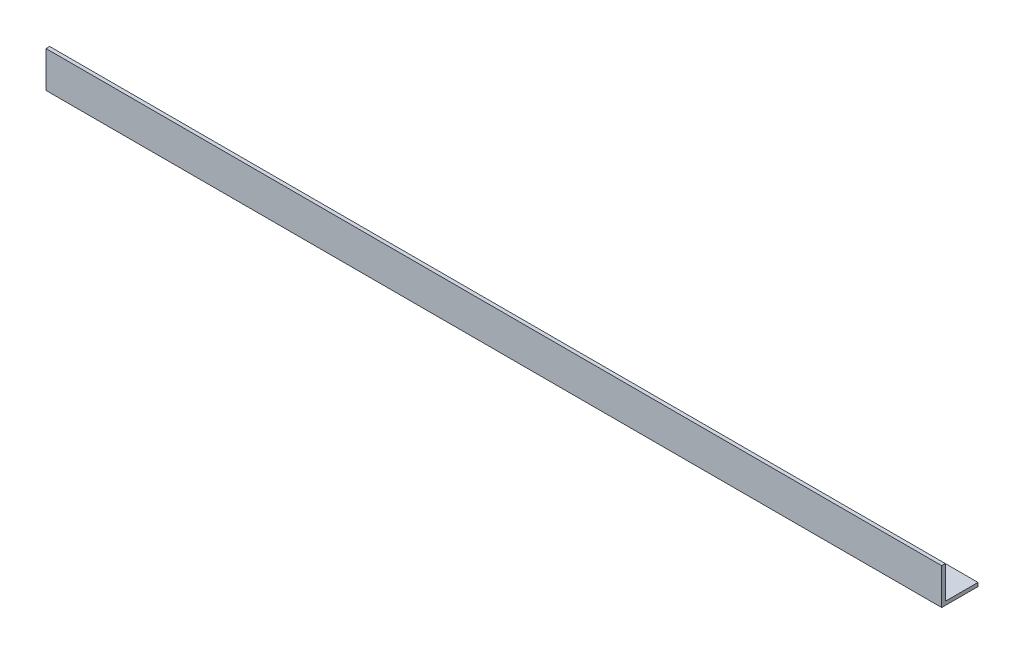
ISO-10303-21;
HEADER;
FILE_DESCRIPTION(('STEP AP214'),'2;1');
FILE_NAME('part.step','',(''),(''),'','','');
FILE_SCHEMA(('AUTOMOTIVE_DESIGN { 1 0 10303 214 1 1 1 1 }'));
ENDSEC;
DATA;
#1=APPLICATION_CONTEXT('core data for automotive mechanical design processes');
#2=APPLICATION_PROTOCOL_DEFINITION('international standard','automotive_design',2000,#1);
#3=PRODUCT_CONTEXT('',#1,'mechanical');
#4=PRODUCT('Part','Part','',(#3));
#5=PRODUCT_RELATED_PRODUCT_CATEGORY('part','',(#4));
#6=PRODUCT_DEFINITION_FORMATION('','',#4);
#7=PRODUCT_DEFINITION_CONTEXT('part definition',#1,'design');
#8=PRODUCT_DEFINITION('design','',#6,#7);
#9=PRODUCT_DEFINITION_SHAPE('','',#8);
#10=(LENGTH_UNIT() NAMED_UNIT(*) SI_UNIT(.MILLI.,.METRE.));
#11=(NAMED_UNIT(*) PLANE_ANGLE_UNIT() SI_UNIT($,.RADIAN.));
#12=(NAMED_UNIT(*) SI_UNIT($,.STERADIAN.) SOLID_ANGLE_UNIT());
#13=UNCERTAINTY_MEASURE_WITH_UNIT(LENGTH_MEASURE(1.E-05),#10,'distance_accuracy_value','');
#14=(GEOMETRIC_REPRESENTATION_CONTEXT(3) GLOBAL_UNCERTAINTY_ASSIGNED_CONTEXT((#13)) GLOBAL_UNIT_ASSIGNED_CONTEXT((#10,
#11,#12)) REPRESENTATION_CONTEXT('',''));
#15=CARTESIAN_POINT('',(0.,0.,0.));
#16=DIRECTION('',(0.,0.,1.));
#17=DIRECTION('',(1.,0.,0.));
#18=AXIS2_PLACEMENT_3D('',#15,#16,#17);
#19=CARTESIAN_POINT('',(370.,0.,-15.));
#20=DIRECTION('',(0.,1.,0.));
#21=DIRECTION('',(0.,0.,1.));
#22=AXIS2_PLACEMENT_3D('',#19,#20,#21);
#23=PLANE('',#22);
#24=DIRECTION('',(0.,0.,-1.));
#25=VECTOR('',#24,1.);
#26=CARTESIAN_POINT('',(0.,0.,-15.));
#27=LINE('',#26,#25);
#28=CARTESIAN_POINT('',(0.,0.,0.));
#29=VERTEX_POINT('',#28);
#30=CARTESIAN_POINT('',(0.,0.,-15.));
#31=VERTEX_POINT('',#30);
#32=EDGE_CURVE('E119',#29,#31,#27,.T.);
#33=ORIENTED_EDGE('',*,*,#32,.T.);
#34=DIRECTION('',(-1.,0.,0.));
#35=VECTOR('',#34,1.);
#36=CARTESIAN_POINT('',(370.,0.,-15.));
#37=LINE('',#36,#35);
#38=CARTESIAN_POINT('',(370.,0.,-15.));
#39=VERTEX_POINT('',#38);
#40=EDGE_CURVE('E11',#39,#31,#37,.T.);
#41=ORIENTED_EDGE('',*,*,#40,.F.);
#42=DIRECTION('',(0.,0.,-1.));
#43=VECTOR('',#42,1.);
#44=CARTESIAN_POINT('',(370.,0.,-15.));
#45=LINE('',#44,#43);
#46=CARTESIAN_POINT('',(370.,0.,0.));
#47=VERTEX_POINT('',#46);
#48=EDGE_CURVE('E129',#47,#39,#45,.T.);
#49=ORIENTED_EDGE('',*,*,#48,.F.);
#50=DIRECTION('',(-1.,0.,0.));
#51=VECTOR('',#50,1.);
#52=CARTESIAN_POINT('',(370.,0.,0.));
#53=LINE('',#52,#51);
#54=EDGE_CURVE('E115',#47,#29,#53,.T.);
#55=ORIENTED_EDGE('',*,*,#54,.T.);
#56=EDGE_LOOP('',(#33,#41,#49,#55));
#57=FACE_BOUND('',#56,.T.);
#58=ADVANCED_FACE('F35',(#57),#23,.F.);
#59=CARTESIAN_POINT('',(370.,1.49999999999998,-15.));
#60=DIRECTION('',(0.,0.,1.));
#61=DIRECTION('',(1.,0.,0.));
#62=AXIS2_PLACEMENT_3D('',#59,#60,#61);
#63=PLANE('',#62);
#64=DIRECTION('',(0.,1.,0.));
#65=VECTOR('',#64,1.);
#66=CARTESIAN_POINT('',(0.,1.49999999999998,-15.));
#67=LINE('',#66,#65);
#68=CARTESIAN_POINT('',(0.,1.49999999999998,-15.));
#69=VERTEX_POINT('',#68);
#70=EDGE_CURVE('E122',#31,#69,#67,.T.);
#71=ORIENTED_EDGE('',*,*,#70,.T.);
#72=DIRECTION('',(-1.,0.,0.));
#73=VECTOR('',#72,1.);
#74=CARTESIAN_POINT('',(370.,1.49999999999998,-15.));
#75=LINE('',#74,#73);
#76=CARTESIAN_POINT('',(370.,1.49999999999998,-15.));
#77=VERTEX_POINT('',#76);
#78=EDGE_CURVE('E43',#77,#69,#75,.T.);
#79=ORIENTED_EDGE('',*,*,#78,.F.);
#80=DIRECTION('',(0.,1.,0.));
#81=VECTOR('',#80,1.);
#82=CARTESIAN_POINT('',(370.,1.49999999999998,-15.));
#83=LINE('',#82,#81);
#84=EDGE_CURVE('E88',#39,#77,#83,.T.);
#85=ORIENTED_EDGE('',*,*,#84,.F.);
#86=ORIENTED_EDGE('',*,*,#40,.T.);
#87=EDGE_LOOP('',(#71,#79,#85,#86));
#88=FACE_BOUND('',#87,.T.);
#89=ADVANCED_FACE('F153',(#88),#63,.F.);
#90=CARTESIAN_POINT('',(370.,1.5,-1.50000000000002));
#91=DIRECTION('',(0.,-1.,0.));
#92=DIRECTION('',(0.,0.,-1.));
#93=AXIS2_PLACEMENT_3D('',#90,#91,#92);
#94=PLANE('',#93);
#95=DIRECTION('',(0.,0.,1.));
#96=VECTOR('',#95,1.);
#97=CARTESIAN_POINT('',(0.,1.5,-1.50000000000002));
#98=LINE('',#97,#96);
#99=CARTESIAN_POINT('',(0.,1.5,-1.50000000000002));
#100=VERTEX_POINT('',#99);
#101=EDGE_CURVE('E124',#69,#100,#98,.T.);
#102=ORIENTED_EDGE('',*,*,#101,.T.);
#103=DIRECTION('',(-1.,0.,0.));
#104=VECTOR('',#103,1.);
#105=CARTESIAN_POINT('',(370.,1.5,-1.50000000000002));
#106=LINE('',#105,#104);
#107=CARTESIAN_POINT('',(370.,1.5,-1.50000000000002));
#108=VERTEX_POINT('',#107);
#109=EDGE_CURVE('E110',#108,#100,#106,.T.);
#110=ORIENTED_EDGE('',*,*,#109,.F.);
#111=DIRECTION('',(0.,0.,1.));
#112=VECTOR('',#111,1.);
#113=CARTESIAN_POINT('',(370.,1.5,-1.50000000000002));
#114=LINE('',#113,#112);
#115=EDGE_CURVE('E101',#77,#108,#114,.T.);
#116=ORIENTED_EDGE('',*,*,#115,.F.);
#117=ORIENTED_EDGE('',*,*,#78,.T.);
#118=EDGE_LOOP('',(#102,#110,#116,#117));
#119=FACE_BOUND('',#118,.T.);
#120=ADVANCED_FACE('F135',(#119),#94,.F.);
#121=CARTESIAN_POINT('',(370.,15.,-1.5));
#122=DIRECTION('',(0.,0.,1.));
#123=DIRECTION('',(0.,-1.,0.));
#124=AXIS2_PLACEMENT_3D('',#121,#122,#123);
#125=PLANE('',#124);
#126=DIRECTION('',(0.,1.,0.));
#127=VECTOR('',#126,1.);
#128=CARTESIAN_POINT('',(0.,15.,-1.5));
#129=LINE('',#128,#127);
#130=CARTESIAN_POINT('',(0.,15.,-1.5));
#131=VERTEX_POINT('',#130);
#132=EDGE_CURVE('E109',#100,#131,#129,.T.);
#133=ORIENTED_EDGE('',*,*,#132,.T.);
#134=DIRECTION('',(-1.,0.,0.));
#135=VECTOR('',#134,1.);
#136=CARTESIAN_POINT('',(370.,15.,-1.5));
#137=LINE('',#136,#135);
#138=CARTESIAN_POINT('',(370.,15.,-1.5));
#139=VERTEX_POINT('',#138);
#140=EDGE_CURVE('E106',#139,#131,#137,.T.);
#141=ORIENTED_EDGE('',*,*,#140,.F.);
#142=DIRECTION('',(0.,1.,0.));
#143=VECTOR('',#142,1.);
#144=CARTESIAN_POINT('',(370.,15.,-1.5));
#145=LINE('',#144,#143);
#146=EDGE_CURVE('E95',#108,#139,#145,.T.);
#147=ORIENTED_EDGE('',*,*,#146,.F.);
#148=ORIENTED_EDGE('',*,*,#109,.T.);
#149=EDGE_LOOP('',(#133,#141,#147,#148));
#150=FACE_BOUND('',#149,.T.);
#151=ADVANCED_FACE('F107',(#150),#125,.F.);
#152=CARTESIAN_POINT('',(370.,15.,0.));
#153=DIRECTION('',(0.,-1.,0.));
#154=DIRECTION('',(0.,0.,-1.));
#155=AXIS2_PLACEMENT_3D('',#152,#153,#154);
#156=PLANE('',#155);
#157=DIRECTION('',(0.,0.,1.));
#158=VECTOR('',#157,1.);
#159=CARTESIAN_POINT('',(0.,15.,0.));
#160=LINE('',#159,#158);
#161=CARTESIAN_POINT('',(0.,15.,0.));
#162=VERTEX_POINT('',#161);
#163=EDGE_CURVE('E74',#131,#162,#160,.T.);
#164=ORIENTED_EDGE('',*,*,#163,.T.);
#165=DIRECTION('',(-1.,0.,0.));
#166=VECTOR('',#165,1.);
#167=CARTESIAN_POINT('',(370.,15.,0.));
#168=LINE('',#167,#166);
#169=CARTESIAN_POINT('',(370.,15.,0.));
#170=VERTEX_POINT('',#169);
#171=EDGE_CURVE('E111',#170,#162,#168,.T.);
#172=ORIENTED_EDGE('',*,*,#171,.F.);
#173=DIRECTION('',(0.,0.,1.));
#174=VECTOR('',#173,1.);
#175=CARTESIAN_POINT('',(370.,15.,0.));
#176=LINE('',#175,#174);
#177=EDGE_CURVE('E99',#139,#170,#176,.T.);
#178=ORIENTED_EDGE('',*,*,#177,.F.);
#179=ORIENTED_EDGE('',*,*,#140,.T.);
#180=EDGE_LOOP('',(#164,#172,#178,#179));
#181=FACE_BOUND('',#180,.T.);
#182=ADVANCED_FACE('F113',(#181),#156,.F.);
#183=CARTESIAN_POINT('',(370.,0.,0.));
#184=DIRECTION('',(0.,0.,-1.));
#185=DIRECTION('',(-1.,0.,0.));
#186=AXIS2_PLACEMENT_3D('',#183,#184,#185);
#187=PLANE('',#186);
#188=DIRECTION('',(0.,-1.,0.));
#189=VECTOR('',#188,1.);
#190=CARTESIAN_POINT('',(0.,0.,0.));
#191=LINE('',#190,#189);
#192=EDGE_CURVE('E80',#162,#29,#191,.T.);
#193=ORIENTED_EDGE('',*,*,#192,.T.);
#194=ORIENTED_EDGE('',*,*,#54,.F.);
#195=DIRECTION('',(0.,-1.,0.));
#196=VECTOR('',#195,1.);
#197=CARTESIAN_POINT('',(370.,0.,0.));
#198=LINE('',#197,#196);
#199=EDGE_CURVE('E51',#170,#47,#198,.T.);
#200=ORIENTED_EDGE('',*,*,#199,.F.);
#201=ORIENTED_EDGE('',*,*,#171,.T.);
#202=EDGE_LOOP('',(#193,#194,#200,#201));
#203=FACE_BOUND('',#202,.T.);
#204=ADVANCED_FACE('F142',(#203),#187,.F.);
#205=CARTESIAN_POINT('',(370.,0.,0.));
#206=DIRECTION('',(-1.,0.,0.));
#207=DIRECTION('',(0.,0.,1.));
#208=AXIS2_PLACEMENT_3D('',#205,#206,#207);
#209=PLANE('',#208);
#210=ORIENTED_EDGE('',*,*,#48,.T.);
#211=ORIENTED_EDGE('',*,*,#84,.T.);
#212=ORIENTED_EDGE('',*,*,#115,.T.);
#213=ORIENTED_EDGE('',*,*,#146,.T.);
#214=ORIENTED_EDGE('',*,*,#177,.T.);
#215=ORIENTED_EDGE('',*,*,#199,.T.);
#216=EDGE_LOOP('',(#210,#211,#212,#213,#214,#215));
#217=FACE_BOUND('',#216,.T.);
#218=ADVANCED_FACE('F97',(#217),#209,.F.);
#219=CARTESIAN_POINT('',(0.,0.,0.));
#220=DIRECTION('',(-1.,0.,0.));
#221=DIRECTION('',(0.,0.,1.));
#222=AXIS2_PLACEMENT_3D('',#219,#220,#221);
#223=PLANE('',#222);
#224=ORIENTED_EDGE('',*,*,#32,.F.);
#225=ORIENTED_EDGE('',*,*,#192,.F.);
#226=ORIENTED_EDGE('',*,*,#163,.F.);
#227=ORIENTED_EDGE('',*,*,#132,.F.);
#228=ORIENTED_EDGE('',*,*,#101,.F.);
#229=ORIENTED_EDGE('',*,*,#70,.F.);
#230=EDGE_LOOP('',(#224,#225,#226,#227,#228,#229));
#231=FACE_BOUND('',#230,.T.);
#232=ADVANCED_FACE('F138',(#231),#223,.T.);
#233=CLOSED_SHELL('',(#58,#89,#120,#151,#182,#204,#218,#232));
#234=MANIFOLD_SOLID_BREP('B2',#233);
#235=ADVANCED_BREP_SHAPE_REPRESENTATION('',(#18,#234),#14);
#236=SHAPE_DEFINITION_REPRESENTATION(#9,#235);
ENDSEC;
END-ISO-10303-21;
